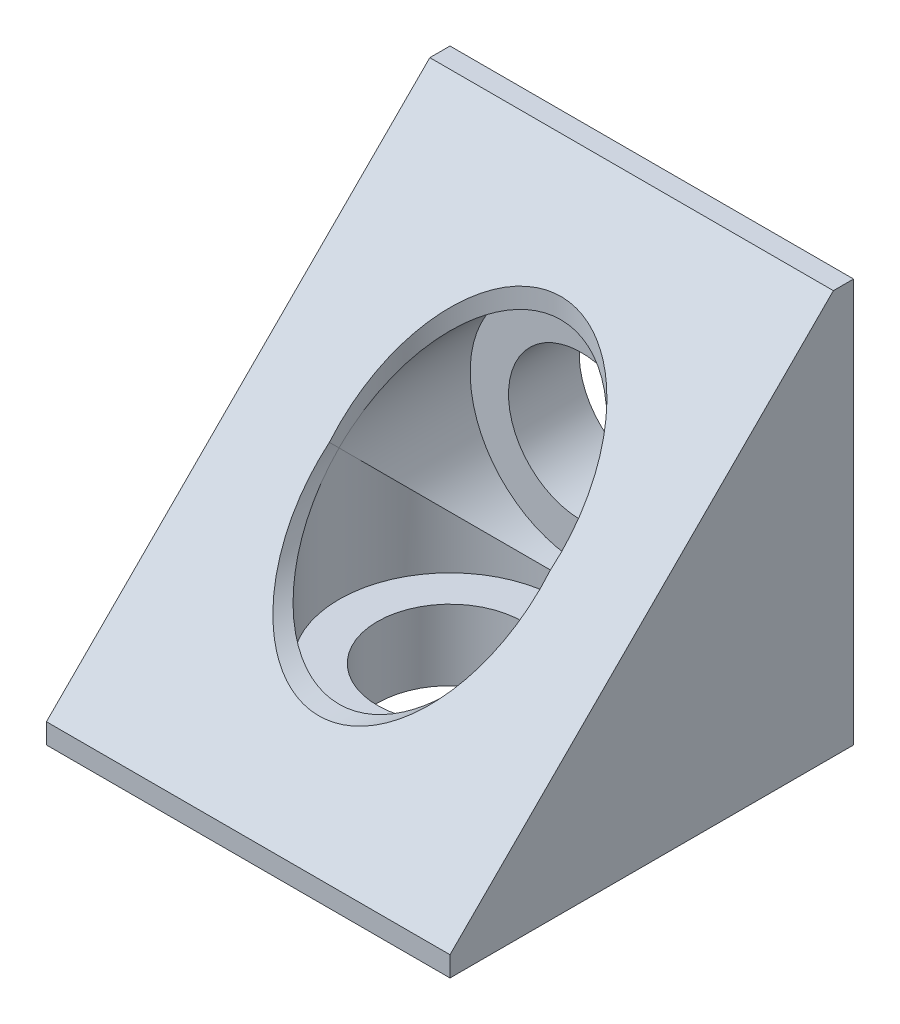
ISO-10303-21;
HEADER;
FILE_DESCRIPTION(('STEP AP214'),'2;1');
FILE_NAME('part.step','',(''),(''),'','','');
FILE_SCHEMA(('AUTOMOTIVE_DESIGN { 1 0 10303 214 1 1 1 1 }'));
ENDSEC;
DATA;
#1=APPLICATION_CONTEXT('core data for automotive mechanical design processes');
#2=APPLICATION_PROTOCOL_DEFINITION('international standard','automotive_design',2000,#1);
#3=PRODUCT_CONTEXT('',#1,'mechanical');
#4=PRODUCT('Part','Part','',(#3));
#5=PRODUCT_RELATED_PRODUCT_CATEGORY('part','',(#4));
#6=PRODUCT_DEFINITION_FORMATION('','',#4);
#7=PRODUCT_DEFINITION_CONTEXT('part definition',#1,'design');
#8=PRODUCT_DEFINITION('design','',#6,#7);
#9=PRODUCT_DEFINITION_SHAPE('','',#8);
#10=(LENGTH_UNIT() NAMED_UNIT(*) SI_UNIT(.MILLI.,.METRE.));
#11=(NAMED_UNIT(*) PLANE_ANGLE_UNIT() SI_UNIT($,.RADIAN.));
#12=(NAMED_UNIT(*) SI_UNIT($,.STERADIAN.) SOLID_ANGLE_UNIT());
#13=UNCERTAINTY_MEASURE_WITH_UNIT(LENGTH_MEASURE(1.E-05),#10,'distance_accuracy_value','');
#14=(GEOMETRIC_REPRESENTATION_CONTEXT(3) GLOBAL_UNCERTAINTY_ASSIGNED_CONTEXT((#13)) GLOBAL_UNIT_ASSIGNED_CONTEXT((#10,
#11,#12)) REPRESENTATION_CONTEXT('',''));
#15=CARTESIAN_POINT('',(0.,0.,0.));
#16=DIRECTION('',(0.,0.,1.));
#17=DIRECTION('',(1.,0.,0.));
#18=AXIS2_PLACEMENT_3D('',#15,#16,#17);
#19=CARTESIAN_POINT('',(0.,0.,-6.5));
#20=DIRECTION('',(0.,0.,1.));
#21=DIRECTION('',(1.,0.,0.));
#22=AXIS2_PLACEMENT_3D('',#19,#20,#21);
#23=CYLINDRICAL_SURFACE('',#22,5.5);
#24=CARTESIAN_POINT('',(0.,0.,0.));
#25=DIRECTION('',(0.,-0.707106781186547,0.707106781186547));
#26=DIRECTION('',(0.,0.707106781186547,0.707106781186547));
#27=AXIS2_PLACEMENT_3D('',#24,#25,#26);
#28=ELLIPSE('',#27,7.77817459305202,5.5);
#29=CARTESIAN_POINT('',(-5.5,0.,0.));
#30=VERTEX_POINT('',#29);
#31=CARTESIAN_POINT('',(-5.47722557505165,0.500000000000052,0.500000000000055));
#32=VERTEX_POINT('',#31);
#33=EDGE_CURVE('E151',#30,#32,#28,.F.);
#34=ORIENTED_EDGE('',*,*,#33,.T.);
#35=CARTESIAN_POINT('',(0.,0.,1.0000000000001));
#36=DIRECTION('',(0.,-0.707106781186544,-0.707106781186552));
#37=DIRECTION('',(0.,-0.707106781186552,0.707106781186544));
#38=AXIS2_PLACEMENT_3D('',#35,#36,#37);
#39=ELLIPSE('',#38,7.77817459305198,5.5);
#40=CARTESIAN_POINT('',(5.47722557505166,0.500000000000053,0.500000000000053));
#41=VERTEX_POINT('',#40);
#42=EDGE_CURVE('E60',#32,#41,#39,.F.);
#43=ORIENTED_EDGE('',*,*,#42,.T.);
#44=CARTESIAN_POINT('',(5.5,0.,0.));
#45=VERTEX_POINT('',#44);
#46=EDGE_CURVE('E141',#41,#45,#28,.F.);
#47=ORIENTED_EDGE('',*,*,#46,.T.);
#48=CARTESIAN_POINT('',(0.,0.,0.));
#49=DIRECTION('',(0.,0.707106781186547,0.707106781186547));
#50=DIRECTION('',(0.,-0.707106781186547,0.707106781186547));
#51=AXIS2_PLACEMENT_3D('',#48,#49,#50);
#52=ELLIPSE('',#51,7.77817459305202,5.5);
#53=EDGE_CURVE('E46',#45,#30,#52,.F.);
#54=ORIENTED_EDGE('',*,*,#53,.T.);
#55=EDGE_LOOP('',(#34,#43,#47,#54));
#56=FACE_BOUND('',#55,.T.);
#57=ADVANCED_FACE('F38',(#56),#23,.F.);
#58=CARTESIAN_POINT('',(0.,-10.,0.));
#59=DIRECTION('',(0.,1.,0.));
#60=DIRECTION('',(-1.,0.,0.));
#61=AXIS2_PLACEMENT_3D('',#58,#59,#60);
#62=CYLINDRICAL_SURFACE('',#61,3.6);
#63=CARTESIAN_POINT('',(0.,-10.,0.));
#64=DIRECTION('',(0.,1.,0.));
#65=DIRECTION('',(-1.,0.,0.));
#66=AXIS2_PLACEMENT_3D('',#63,#64,#65);
#67=CIRCLE('',#66,3.6);
#68=CARTESIAN_POINT('',(-3.6,-10.,0.));
#69=VERTEX_POINT('',#68);
#70=EDGE_CURVE('E149',#69,#69,#67,.T.);
#71=ORIENTED_EDGE('',*,*,#70,.F.);
#72=EDGE_LOOP('',(#71));
#73=FACE_BOUND('',#72,.T.);
#74=CARTESIAN_POINT('',(0.,-6.5,0.));
#75=DIRECTION('',(0.,1.,0.));
#76=DIRECTION('',(-1.,0.,0.));
#77=AXIS2_PLACEMENT_3D('',#74,#75,#76);
#78=CIRCLE('',#77,3.6);
#79=CARTESIAN_POINT('',(-3.6,-6.50000000000001,0.));
#80=VERTEX_POINT('',#79);
#81=EDGE_CURVE('E146',#80,#80,#78,.F.);
#82=ORIENTED_EDGE('',*,*,#81,.F.);
#83=EDGE_LOOP('',(#82));
#84=FACE_BOUND('',#83,.T.);
#85=ADVANCED_FACE('F196',(#73,#84),#62,.F.);
#86=CARTESIAN_POINT('',(0.,0.,10.));
#87=DIRECTION('',(0.,0.,-1.));
#88=DIRECTION('',(-1.,0.,0.));
#89=AXIS2_PLACEMENT_3D('',#86,#87,#88);
#90=CYLINDRICAL_SURFACE('',#89,3.6);
#91=CARTESIAN_POINT('',(0.,0.,-10.));
#92=DIRECTION('',(0.,0.,1.));
#93=DIRECTION('',(1.,0.,0.));
#94=AXIS2_PLACEMENT_3D('',#91,#92,#93);
#95=CIRCLE('',#94,3.6);
#96=CARTESIAN_POINT('',(3.6,0.,-10.));
#97=VERTEX_POINT('',#96);
#98=EDGE_CURVE('E123',#97,#97,#95,.T.);
#99=ORIENTED_EDGE('',*,*,#98,.F.);
#100=EDGE_LOOP('',(#99));
#101=FACE_BOUND('',#100,.T.);
#102=CARTESIAN_POINT('',(0.,0.,-6.5));
#103=DIRECTION('',(0.,0.,1.));
#104=DIRECTION('',(1.,0.,0.));
#105=AXIS2_PLACEMENT_3D('',#102,#103,#104);
#106=CIRCLE('',#105,3.6);
#107=CARTESIAN_POINT('',(3.6,0.,-6.5));
#108=VERTEX_POINT('',#107);
#109=EDGE_CURVE('E142',#108,#108,#106,.T.);
#110=ORIENTED_EDGE('',*,*,#109,.T.);
#111=EDGE_LOOP('',(#110));
#112=FACE_BOUND('',#111,.T.);
#113=ADVANCED_FACE('F200',(#101,#112),#90,.F.);
#114=CARTESIAN_POINT('',(0.,0.,10.));
#115=DIRECTION('',(0.,0.,1.));
#116=DIRECTION('',(1.,0.,0.));
#117=AXIS2_PLACEMENT_3D('',#114,#115,#116);
#118=PLANE('',#117);
#119=DIRECTION('',(1.,0.,0.));
#120=VECTOR('',#119,1.);
#121=CARTESIAN_POINT('',(-9.99999999999999,-9.,10.));
#122=LINE('',#121,#120);
#123=CARTESIAN_POINT('',(-9.99999999999999,-9.,10.));
#124=VERTEX_POINT('',#123);
#125=CARTESIAN_POINT('',(10.,-9.,10.));
#126=VERTEX_POINT('',#125);
#127=EDGE_CURVE('E97',#124,#126,#122,.T.);
#128=ORIENTED_EDGE('',*,*,#127,.F.);
#129=DIRECTION('',(0.,-1.,0.));
#130=VECTOR('',#129,1.);
#131=CARTESIAN_POINT('',(-10.,-10.,10.));
#132=LINE('',#131,#130);
#133=CARTESIAN_POINT('',(-10.,-10.,10.));
#134=VERTEX_POINT('',#133);
#135=EDGE_CURVE('E106',#124,#134,#132,.T.);
#136=ORIENTED_EDGE('',*,*,#135,.T.);
#137=DIRECTION('',(1.,0.,0.));
#138=VECTOR('',#137,1.);
#139=CARTESIAN_POINT('',(10.,-10.,10.));
#140=LINE('',#139,#138);
#141=CARTESIAN_POINT('',(10.,-10.,10.));
#142=VERTEX_POINT('',#141);
#143=EDGE_CURVE('E115',#134,#142,#140,.T.);
#144=ORIENTED_EDGE('',*,*,#143,.T.);
#145=DIRECTION('',(0.,1.,0.));
#146=VECTOR('',#145,1.);
#147=CARTESIAN_POINT('',(10.,-10.,10.));
#148=LINE('',#147,#146);
#149=EDGE_CURVE('E109',#142,#126,#148,.T.);
#150=ORIENTED_EDGE('',*,*,#149,.T.);
#151=EDGE_LOOP('',(#128,#136,#144,#150));
#152=FACE_BOUND('',#151,.T.);
#153=ADVANCED_FACE('F105',(#152),#118,.T.);
#154=CARTESIAN_POINT('',(0.,0.,-10.));
#155=DIRECTION('',(0.,0.,1.));
#156=DIRECTION('',(1.,0.,0.));
#157=AXIS2_PLACEMENT_3D('',#154,#155,#156);
#158=PLANE('',#157);
#159=DIRECTION('',(0.,-1.,0.));
#160=VECTOR('',#159,1.);
#161=CARTESIAN_POINT('',(-10.,-10.,-10.));
#162=LINE('',#161,#160);
#163=CARTESIAN_POINT('',(-10.,9.99999999999999,-10.));
#164=VERTEX_POINT('',#163);
#165=CARTESIAN_POINT('',(-10.,-10.,-10.));
#166=VERTEX_POINT('',#165);
#167=EDGE_CURVE('E128',#164,#166,#162,.T.);
#168=ORIENTED_EDGE('',*,*,#167,.F.);
#169=DIRECTION('',(-1.,0.,0.));
#170=VECTOR('',#169,1.);
#171=CARTESIAN_POINT('',(10.,10.,-10.));
#172=LINE('',#171,#170);
#173=CARTESIAN_POINT('',(10.,10.,-10.));
#174=VERTEX_POINT('',#173);
#175=EDGE_CURVE('E116',#174,#164,#172,.T.);
#176=ORIENTED_EDGE('',*,*,#175,.F.);
#177=DIRECTION('',(0.,1.,0.));
#178=VECTOR('',#177,1.);
#179=CARTESIAN_POINT('',(10.,-10.,-10.));
#180=LINE('',#179,#178);
#181=CARTESIAN_POINT('',(10.,-10.,-10.));
#182=VERTEX_POINT('',#181);
#183=EDGE_CURVE('E120',#182,#174,#180,.T.);
#184=ORIENTED_EDGE('',*,*,#183,.F.);
#185=DIRECTION('',(1.,0.,0.));
#186=VECTOR('',#185,1.);
#187=CARTESIAN_POINT('',(10.,-10.,-10.));
#188=LINE('',#187,#186);
#189=EDGE_CURVE('E130',#166,#182,#188,.T.);
#190=ORIENTED_EDGE('',*,*,#189,.F.);
#191=EDGE_LOOP('',(#168,#176,#184,#190));
#192=FACE_BOUND('',#191,.T.);
#193=ORIENTED_EDGE('',*,*,#98,.T.);
#194=EDGE_LOOP('',(#193));
#195=FACE_BOUND('',#194,.T.);
#196=ADVANCED_FACE('F282',(#192,#195),#158,.F.);
#197=CARTESIAN_POINT('',(-10.,-10.,10.));
#198=DIRECTION('',(1.,0.,0.));
#199=DIRECTION('',(0.,0.,-1.));
#200=AXIS2_PLACEMENT_3D('',#197,#198,#199);
#201=PLANE('',#200);
#202=ORIENTED_EDGE('',*,*,#135,.F.);
#203=DIRECTION('',(0.,0.707106781186552,-0.707106781186544));
#204=VECTOR('',#203,1.);
#205=CARTESIAN_POINT('',(-9.99999999999999,-9.,10.));
#206=LINE('',#205,#204);
#207=CARTESIAN_POINT('',(-9.99999999999999,10.,-8.99999999999979));
#208=VERTEX_POINT('',#207);
#209=EDGE_CURVE('E94',#124,#208,#206,.T.);
#210=ORIENTED_EDGE('',*,*,#209,.T.);
#211=DIRECTION('',(0.,0.,-1.));
#212=VECTOR('',#211,1.);
#213=CARTESIAN_POINT('',(-10.,9.99999999999999,10.));
#214=LINE('',#213,#212);
#215=EDGE_CURVE('E127',#208,#164,#214,.T.);
#216=ORIENTED_EDGE('',*,*,#215,.T.);
#217=ORIENTED_EDGE('',*,*,#167,.T.);
#218=DIRECTION('',(0.,0.,-1.));
#219=VECTOR('',#218,1.);
#220=CARTESIAN_POINT('',(-10.,-10.,10.));
#221=LINE('',#220,#219);
#222=EDGE_CURVE('E114',#134,#166,#221,.T.);
#223=ORIENTED_EDGE('',*,*,#222,.F.);
#224=EDGE_LOOP('',(#202,#210,#216,#217,#223));
#225=FACE_BOUND('',#224,.T.);
#226=ADVANCED_FACE('F40',(#225),#201,.F.);
#227=CARTESIAN_POINT('',(10.,-10.,10.));
#228=DIRECTION('',(0.,1.,0.));
#229=DIRECTION('',(-1.,0.,0.));
#230=AXIS2_PLACEMENT_3D('',#227,#228,#229);
#231=PLANE('',#230);
#232=ORIENTED_EDGE('',*,*,#70,.T.);
#233=EDGE_LOOP('',(#232));
#234=FACE_BOUND('',#233,.T.);
#235=ORIENTED_EDGE('',*,*,#189,.T.);
#236=DIRECTION('',(0.,0.,-1.));
#237=VECTOR('',#236,1.);
#238=CARTESIAN_POINT('',(10.,-10.,10.));
#239=LINE('',#238,#237);
#240=EDGE_CURVE('E137',#142,#182,#239,.T.);
#241=ORIENTED_EDGE('',*,*,#240,.F.);
#242=ORIENTED_EDGE('',*,*,#143,.F.);
#243=ORIENTED_EDGE('',*,*,#222,.T.);
#244=EDGE_LOOP('',(#235,#241,#242,#243));
#245=FACE_BOUND('',#244,.T.);
#246=ADVANCED_FACE('F247',(#234,#245),#231,.F.);
#247=CARTESIAN_POINT('',(10.,-10.,10.));
#248=DIRECTION('',(-1.,0.,0.));
#249=DIRECTION('',(0.,0.,1.));
#250=AXIS2_PLACEMENT_3D('',#247,#248,#249);
#251=PLANE('',#250);
#252=DIRECTION('',(0.,0.,-1.));
#253=VECTOR('',#252,1.);
#254=CARTESIAN_POINT('',(10.,10.,10.));
#255=LINE('',#254,#253);
#256=CARTESIAN_POINT('',(10.,10.,-8.99999999999979));
#257=VERTEX_POINT('',#256);
#258=EDGE_CURVE('E135',#257,#174,#255,.T.);
#259=ORIENTED_EDGE('',*,*,#258,.F.);
#260=DIRECTION('',(0.,0.707106781186552,-0.707106781186544));
#261=VECTOR('',#260,1.);
#262=CARTESIAN_POINT('',(10.,-9.,10.));
#263=LINE('',#262,#261);
#264=EDGE_CURVE('E53',#126,#257,#263,.T.);
#265=ORIENTED_EDGE('',*,*,#264,.F.);
#266=ORIENTED_EDGE('',*,*,#149,.F.);
#267=ORIENTED_EDGE('',*,*,#240,.T.);
#268=ORIENTED_EDGE('',*,*,#183,.T.);
#269=EDGE_LOOP('',(#259,#265,#266,#267,#268));
#270=FACE_BOUND('',#269,.T.);
#271=ADVANCED_FACE('F191',(#270),#251,.F.);
#272=CARTESIAN_POINT('',(10.,10.,10.));
#273=DIRECTION('',(0.,-1.,0.));
#274=DIRECTION('',(1.,0.,0.));
#275=AXIS2_PLACEMENT_3D('',#272,#273,#274);
#276=PLANE('',#275);
#277=ORIENTED_EDGE('',*,*,#215,.F.);
#278=DIRECTION('',(1.,0.,0.));
#279=VECTOR('',#278,1.);
#280=CARTESIAN_POINT('',(-9.99999999999999,10.,-8.99999999999979));
#281=LINE('',#280,#279);
#282=EDGE_CURVE('E98',#208,#257,#281,.T.);
#283=ORIENTED_EDGE('',*,*,#282,.T.);
#284=ORIENTED_EDGE('',*,*,#258,.T.);
#285=ORIENTED_EDGE('',*,*,#175,.T.);
#286=EDGE_LOOP('',(#277,#283,#284,#285));
#287=FACE_BOUND('',#286,.T.);
#288=ADVANCED_FACE('F182',(#287),#276,.F.);
#289=CARTESIAN_POINT('',(0.,0.,0.));
#290=DIRECTION('',(0.,-0.707106781186547,0.707106781186547));
#291=DIRECTION('',(0.,0.707106781186547,0.707106781186547));
#292=AXIS2_PLACEMENT_3D('',#289,#290,#291);
#293=ELLIPSE('',#292,7.77817459305202,5.5);
#294=EDGE_CURVE('E154',#30,#45,#293,.T.);
#295=ORIENTED_EDGE('',*,*,#294,.T.);
#296=CARTESIAN_POINT('',(0.,0.,0.));
#297=DIRECTION('',(0.,0.707106781186547,0.707106781186547));
#298=DIRECTION('',(0.,-0.707106781186547,0.707106781186547));
#299=AXIS2_PLACEMENT_3D('',#296,#297,#298);
#300=ELLIPSE('',#299,7.77817459305202,5.5);
#301=EDGE_CURVE('E157',#45,#30,#300,.T.);
#302=ORIENTED_EDGE('',*,*,#301,.T.);
#303=EDGE_LOOP('',(#295,#302));
#304=FACE_BOUND('',#303,.T.);
#305=CARTESIAN_POINT('',(0.,0.,-6.5));
#306=DIRECTION('',(0.,0.,1.));
#307=DIRECTION('',(1.,0.,0.));
#308=AXIS2_PLACEMENT_3D('',#305,#306,#307);
#309=CIRCLE('',#308,5.5);
#310=CARTESIAN_POINT('',(5.5,0.,-6.5));
#311=VERTEX_POINT('',#310);
#312=EDGE_CURVE('E145',#311,#311,#309,.T.);
#313=ORIENTED_EDGE('',*,*,#312,.F.);
#314=EDGE_LOOP('',(#313));
#315=FACE_BOUND('',#314,.T.);
#316=ADVANCED_FACE('F167',(#304,#315),#23,.F.);
#317=CARTESIAN_POINT('',(0.,0.,-6.5));
#318=DIRECTION('',(0.,0.,1.));
#319=DIRECTION('',(1.,0.,0.));
#320=AXIS2_PLACEMENT_3D('',#317,#318,#319);
#321=PLANE('',#320);
#322=ORIENTED_EDGE('',*,*,#109,.F.);
#323=EDGE_LOOP('',(#322));
#324=FACE_BOUND('',#323,.T.);
#325=ORIENTED_EDGE('',*,*,#312,.T.);
#326=EDGE_LOOP('',(#325));
#327=FACE_BOUND('',#326,.T.);
#328=ADVANCED_FACE('F180',(#324,#327),#321,.T.);
#329=CARTESIAN_POINT('',(0.,-6.5,0.));
#330=DIRECTION('',(0.,1.,0.));
#331=DIRECTION('',(-1.,0.,0.));
#332=AXIS2_PLACEMENT_3D('',#329,#330,#331);
#333=PLANE('',#332);
#334=CARTESIAN_POINT('',(0.,-6.5,0.));
#335=DIRECTION('',(0.,1.,0.));
#336=DIRECTION('',(-1.,0.,0.));
#337=AXIS2_PLACEMENT_3D('',#334,#335,#336);
#338=CIRCLE('',#337,5.5);
#339=CARTESIAN_POINT('',(-5.5,-6.50000000000001,0.));
#340=VERTEX_POINT('',#339);
#341=EDGE_CURVE('E150',#340,#340,#338,.T.);
#342=ORIENTED_EDGE('',*,*,#341,.T.);
#343=EDGE_LOOP('',(#342));
#344=FACE_BOUND('',#343,.T.);
#345=ORIENTED_EDGE('',*,*,#81,.T.);
#346=EDGE_LOOP('',(#345));
#347=FACE_BOUND('',#346,.T.);
#348=ADVANCED_FACE('F188',(#344,#347),#333,.T.);
#349=CARTESIAN_POINT('',(0.,-6.5,0.));
#350=DIRECTION('',(0.,1.,0.));
#351=DIRECTION('',(-1.,0.,0.));
#352=AXIS2_PLACEMENT_3D('',#349,#350,#351);
#353=CYLINDRICAL_SURFACE('',#352,5.5);
#354=ORIENTED_EDGE('',*,*,#341,.F.);
#355=EDGE_LOOP('',(#354));
#356=FACE_BOUND('',#355,.T.);
#357=ORIENTED_EDGE('',*,*,#294,.F.);
#358=ORIENTED_EDGE('',*,*,#53,.F.);
#359=EDGE_LOOP('',(#357,#358));
#360=FACE_BOUND('',#359,.T.);
#361=ADVANCED_FACE('F210',(#356,#360),#353,.F.);
#362=ORIENTED_EDGE('',*,*,#46,.F.);
#363=CARTESIAN_POINT('',(0.,1.00000000000011,0.));
#364=DIRECTION('',(0.,-0.707106781186544,-0.707106781186552));
#365=DIRECTION('',(0.,0.707106781186552,-0.707106781186544));
#366=AXIS2_PLACEMENT_3D('',#363,#364,#365);
#367=ELLIPSE('',#366,7.77817459305207,5.5);
#368=EDGE_CURVE('E11',#41,#32,#367,.F.);
#369=ORIENTED_EDGE('',*,*,#368,.T.);
#370=ORIENTED_EDGE('',*,*,#33,.F.);
#371=ORIENTED_EDGE('',*,*,#301,.F.);
#372=EDGE_LOOP('',(#362,#369,#370,#371));
#373=FACE_BOUND('',#372,.T.);
#374=ADVANCED_FACE('F170',(#373),#353,.F.);
#375=CARTESIAN_POINT('',(-9.99999999999999,-9.,10.));
#376=DIRECTION('',(0.,-0.707106781186544,-0.707106781186552));
#377=DIRECTION('',(0.,0.707106781186552,-0.707106781186544));
#378=AXIS2_PLACEMENT_3D('',#375,#376,#377);
#379=PLANE('',#378);
#380=ORIENTED_EDGE('',*,*,#264,.T.);
#381=ORIENTED_EDGE('',*,*,#282,.F.);
#382=ORIENTED_EDGE('',*,*,#209,.F.);
#383=ORIENTED_EDGE('',*,*,#127,.T.);
#384=EDGE_LOOP('',(#380,#381,#382,#383));
#385=FACE_BOUND('',#384,.T.);
#386=ORIENTED_EDGE('',*,*,#368,.F.);
#387=ORIENTED_EDGE('',*,*,#42,.F.);
#388=EDGE_LOOP('',(#386,#387));
#389=FACE_BOUND('',#388,.T.);
#390=ADVANCED_FACE('F96',(#385,#389),#379,.F.);
#391=CLOSED_SHELL('',(#57,#85,#113,#153,#196,#226,#246,#271,#288,#316,#328,#348,#361,#374,#390));
#392=MANIFOLD_SOLID_BREP('B2',#391);
#393=ADVANCED_BREP_SHAPE_REPRESENTATION('',(#18,#392),#14);
#394=SHAPE_DEFINITION_REPRESENTATION(#9,#393);
ENDSEC;
END-ISO-10303-21;
